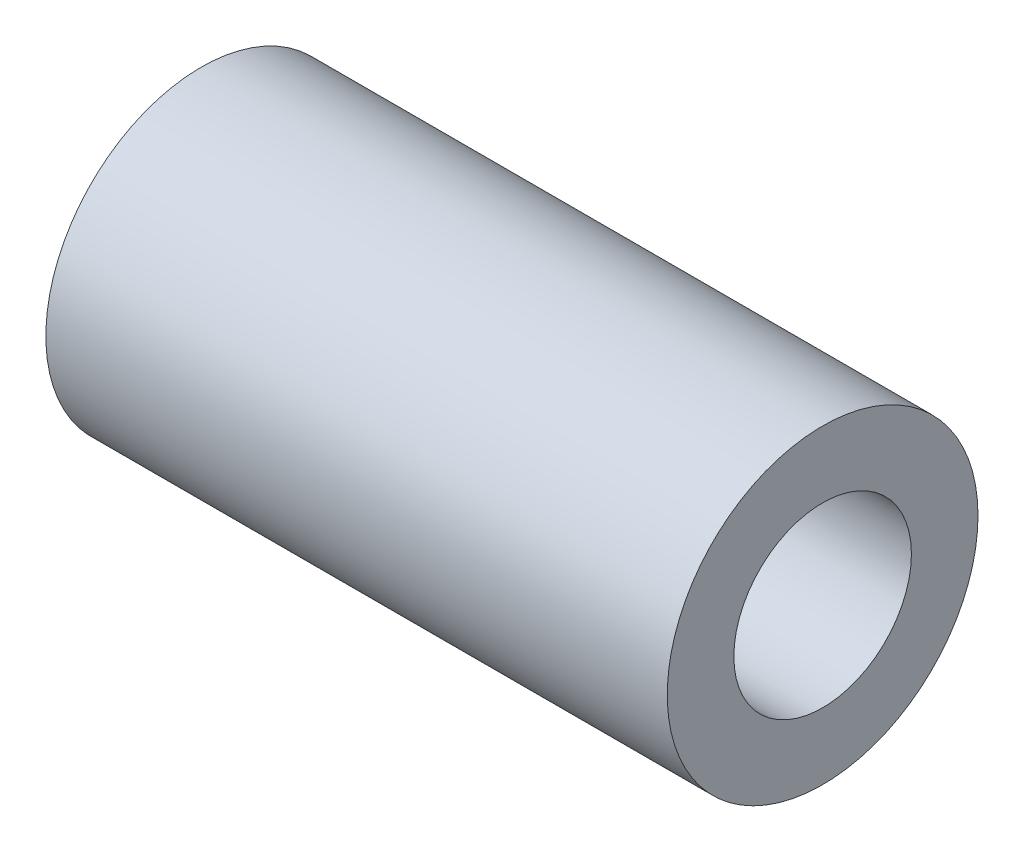
ISO-10303-21;
HEADER;
FILE_DESCRIPTION(('STEP AP214'),'2;1');
FILE_NAME('part.step','',(''),(''),'','','');
FILE_SCHEMA(('AUTOMOTIVE_DESIGN { 1 0 10303 214 1 1 1 1 }'));
ENDSEC;
DATA;
#1=APPLICATION_CONTEXT('core data for automotive mechanical design processes');
#2=APPLICATION_PROTOCOL_DEFINITION('international standard','automotive_design',2000,#1);
#3=PRODUCT_CONTEXT('',#1,'mechanical');
#4=PRODUCT('Part','Part','',(#3));
#5=PRODUCT_RELATED_PRODUCT_CATEGORY('part','',(#4));
#6=PRODUCT_DEFINITION_FORMATION('','',#4);
#7=PRODUCT_DEFINITION_CONTEXT('part definition',#1,'design');
#8=PRODUCT_DEFINITION('design','',#6,#7);
#9=PRODUCT_DEFINITION_SHAPE('','',#8);
#10=(LENGTH_UNIT() NAMED_UNIT(*) SI_UNIT(.MILLI.,.METRE.));
#11=(NAMED_UNIT(*) PLANE_ANGLE_UNIT() SI_UNIT($,.RADIAN.));
#12=(NAMED_UNIT(*) SI_UNIT($,.STERADIAN.) SOLID_ANGLE_UNIT());
#13=UNCERTAINTY_MEASURE_WITH_UNIT(LENGTH_MEASURE(1.E-05),#10,'distance_accuracy_value','');
#14=(GEOMETRIC_REPRESENTATION_CONTEXT(3) GLOBAL_UNCERTAINTY_ASSIGNED_CONTEXT((#13)) GLOBAL_UNIT_ASSIGNED_CONTEXT((#10,
#11,#12)) REPRESENTATION_CONTEXT('',''));
#15=CARTESIAN_POINT('',(0.,0.,0.));
#16=DIRECTION('',(0.,0.,1.));
#17=DIRECTION('',(1.,0.,0.));
#18=AXIS2_PLACEMENT_3D('',#15,#16,#17);
#19=CARTESIAN_POINT('',(-28.,0.,0.));
#20=DIRECTION('',(1.,0.,0.));
#21=DIRECTION('',(0.,0.,-1.));
#22=AXIS2_PLACEMENT_3D('',#19,#20,#21);
#23=CYLINDRICAL_SURFACE('',#22,7.);
#24=CARTESIAN_POINT('',(-28.,0.,0.));
#25=DIRECTION('',(1.,0.,0.));
#26=DIRECTION('',(0.,0.,-1.));
#27=AXIS2_PLACEMENT_3D('',#24,#25,#26);
#28=CIRCLE('',#27,7.);
#29=CARTESIAN_POINT('',(-28.,0.,-7.));
#30=VERTEX_POINT('',#29);
#31=EDGE_CURVE('E10',#30,#30,#28,.T.);
#32=ORIENTED_EDGE('',*,*,#31,.T.);
#33=EDGE_LOOP('',(#32));
#34=FACE_BOUND('',#33,.T.);
#35=CARTESIAN_POINT('',(0.,0.,0.));
#36=DIRECTION('',(1.,0.,0.));
#37=DIRECTION('',(0.,0.,-1.));
#38=AXIS2_PLACEMENT_3D('',#35,#36,#37);
#39=CIRCLE('',#38,7.);
#40=CARTESIAN_POINT('',(0.,0.,-7.));
#41=VERTEX_POINT('',#40);
#42=EDGE_CURVE('E34',#41,#41,#39,.T.);
#43=ORIENTED_EDGE('',*,*,#42,.F.);
#44=EDGE_LOOP('',(#43));
#45=FACE_BOUND('',#44,.T.);
#46=ADVANCED_FACE('F31',(#34,#45),#23,.T.);
#47=CARTESIAN_POINT('',(-28.,0.,0.));
#48=DIRECTION('',(1.,0.,0.));
#49=DIRECTION('',(0.,0.,-1.));
#50=AXIS2_PLACEMENT_3D('',#47,#48,#49);
#51=PLANE('',#50);
#52=CARTESIAN_POINT('',(-28.,0.,0.));
#53=DIRECTION('',(1.,0.,0.));
#54=DIRECTION('',(0.,0.,-1.));
#55=AXIS2_PLACEMENT_3D('',#52,#53,#54);
#56=CIRCLE('',#55,4.);
#57=CARTESIAN_POINT('',(-28.,0.,-4.));
#58=VERTEX_POINT('',#57);
#59=EDGE_CURVE('E41',#58,#58,#56,.T.);
#60=ORIENTED_EDGE('',*,*,#59,.T.);
#61=EDGE_LOOP('',(#60));
#62=FACE_BOUND('',#61,.T.);
#63=ORIENTED_EDGE('',*,*,#31,.F.);
#64=EDGE_LOOP('',(#63));
#65=FACE_BOUND('',#64,.T.);
#66=ADVANCED_FACE('F49',(#62,#65),#51,.F.);
#67=CARTESIAN_POINT('',(0.,0.,0.));
#68=DIRECTION('',(1.,0.,0.));
#69=DIRECTION('',(0.,0.,-1.));
#70=AXIS2_PLACEMENT_3D('',#67,#68,#69);
#71=PLANE('',#70);
#72=CARTESIAN_POINT('',(0.,0.,0.));
#73=DIRECTION('',(1.,0.,0.));
#74=DIRECTION('',(0.,0.,-1.));
#75=AXIS2_PLACEMENT_3D('',#72,#73,#74);
#76=CIRCLE('',#75,4.);
#77=CARTESIAN_POINT('',(0.,0.,-4.));
#78=VERTEX_POINT('',#77);
#79=EDGE_CURVE('E43',#78,#78,#76,.T.);
#80=ORIENTED_EDGE('',*,*,#79,.F.);
#81=EDGE_LOOP('',(#80));
#82=FACE_BOUND('',#81,.T.);
#83=ORIENTED_EDGE('',*,*,#42,.T.);
#84=EDGE_LOOP('',(#83));
#85=FACE_BOUND('',#84,.T.);
#86=ADVANCED_FACE('F55',(#82,#85),#71,.T.);
#87=CARTESIAN_POINT('',(-28.,0.,0.));
#88=DIRECTION('',(1.,0.,0.));
#89=DIRECTION('',(0.,0.,-1.));
#90=AXIS2_PLACEMENT_3D('',#87,#88,#89);
#91=CYLINDRICAL_SURFACE('',#90,4.);
#92=ORIENTED_EDGE('',*,*,#59,.F.);
#93=EDGE_LOOP('',(#92));
#94=FACE_BOUND('',#93,.T.);
#95=ORIENTED_EDGE('',*,*,#79,.T.);
#96=EDGE_LOOP('',(#95));
#97=FACE_BOUND('',#96,.T.);
#98=ADVANCED_FACE('F52',(#94,#97),#91,.F.);
#99=CLOSED_SHELL('',(#46,#66,#86,#98));
#100=MANIFOLD_SOLID_BREP('B2',#99);
#101=ADVANCED_BREP_SHAPE_REPRESENTATION('',(#18,#100),#14);
#102=SHAPE_DEFINITION_REPRESENTATION(#9,#101);
ENDSEC;
END-ISO-10303-21;
